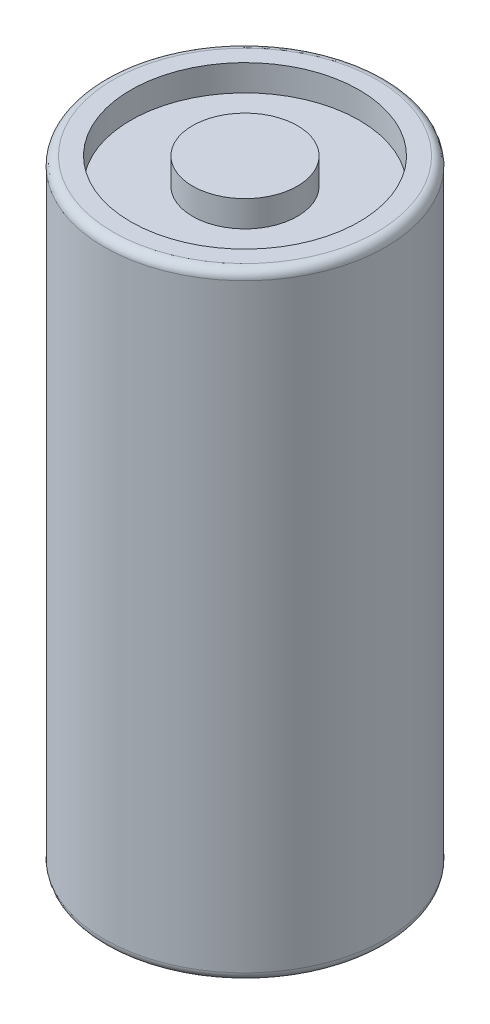
ISO-10303-21;
HEADER;
FILE_DESCRIPTION(('STEP AP214'),'2;1');
FILE_NAME('part.step','',(''),(''),'','','');
FILE_SCHEMA(('AUTOMOTIVE_DESIGN { 1 0 10303 214 1 1 1 1 }'));
ENDSEC;
DATA;
#1=APPLICATION_CONTEXT('core data for automotive mechanical design processes');
#2=APPLICATION_PROTOCOL_DEFINITION('international standard','automotive_design',2000,#1);
#3=PRODUCT_CONTEXT('',#1,'mechanical');
#4=PRODUCT('Part','Part','',(#3));
#5=PRODUCT_RELATED_PRODUCT_CATEGORY('part','',(#4));
#6=PRODUCT_DEFINITION_FORMATION('','',#4);
#7=PRODUCT_DEFINITION_CONTEXT('part definition',#1,'design');
#8=PRODUCT_DEFINITION('design','',#6,#7);
#9=PRODUCT_DEFINITION_SHAPE('','',#8);
#10=(LENGTH_UNIT() NAMED_UNIT(*) SI_UNIT(.MILLI.,.METRE.));
#11=(NAMED_UNIT(*) PLANE_ANGLE_UNIT() SI_UNIT($,.RADIAN.));
#12=(NAMED_UNIT(*) SI_UNIT($,.STERADIAN.) SOLID_ANGLE_UNIT());
#13=UNCERTAINTY_MEASURE_WITH_UNIT(LENGTH_MEASURE(1.E-05),#10,'distance_accuracy_value','');
#14=(GEOMETRIC_REPRESENTATION_CONTEXT(3) GLOBAL_UNCERTAINTY_ASSIGNED_CONTEXT((#13)) GLOBAL_UNIT_ASSIGNED_CONTEXT((#10,
#11,#12)) REPRESENTATION_CONTEXT('',''));
#15=CARTESIAN_POINT('',(0.,0.,0.));
#16=DIRECTION('',(0.,0.,1.));
#17=DIRECTION('',(1.,0.,0.));
#18=AXIS2_PLACEMENT_3D('',#15,#16,#17);
#19=CARTESIAN_POINT('',(0.,70.6,0.));
#20=DIRECTION('',(0.,-1.,0.));
#21=DIRECTION('',(0.,0.,-1.));
#22=AXIS2_PLACEMENT_3D('',#19,#20,#21);
#23=CYLINDRICAL_SURFACE('',#22,16.1);
#24=CARTESIAN_POINT('',(0.,69.6,0.));
#25=DIRECTION('',(0.,1.,0.));
#26=DIRECTION('',(0.,0.,1.));
#27=AXIS2_PLACEMENT_3D('',#24,#25,#26);
#28=CIRCLE('',#27,16.1);
#29=CARTESIAN_POINT('',(0.,69.6,16.1));
#30=VERTEX_POINT('',#29);
#31=EDGE_CURVE('E10',#30,#30,#28,.F.);
#32=ORIENTED_EDGE('',*,*,#31,.T.);
#33=EDGE_LOOP('',(#32));
#34=FACE_BOUND('',#33,.T.);
#35=CARTESIAN_POINT('',(0.,1.,0.));
#36=DIRECTION('',(0.,1.,0.));
#37=DIRECTION('',(0.,0.,1.));
#38=AXIS2_PLACEMENT_3D('',#35,#36,#37);
#39=CIRCLE('',#38,16.1);
#40=CARTESIAN_POINT('',(0.,1.,16.1));
#41=VERTEX_POINT('',#40);
#42=EDGE_CURVE('E51',#41,#41,#39,.T.);
#43=ORIENTED_EDGE('',*,*,#42,.T.);
#44=EDGE_LOOP('',(#43));
#45=FACE_BOUND('',#44,.T.);
#46=ADVANCED_FACE('F36',(#34,#45),#23,.T.);
#47=CARTESIAN_POINT('',(0.,70.6,0.));
#48=DIRECTION('',(0.,1.,0.));
#49=DIRECTION('',(0.,0.,1.));
#50=AXIS2_PLACEMENT_3D('',#47,#48,#49);
#51=PLANE('',#50);
#52=CARTESIAN_POINT('',(0.,70.6,0.));
#53=DIRECTION('',(0.,1.,0.));
#54=DIRECTION('',(0.,0.,1.));
#55=AXIS2_PLACEMENT_3D('',#52,#53,#54);
#56=CIRCLE('',#55,15.1);
#57=CARTESIAN_POINT('',(0.,70.6,15.1));
#58=VERTEX_POINT('',#57);
#59=EDGE_CURVE('E43',#58,#58,#56,.T.);
#60=ORIENTED_EDGE('',*,*,#59,.T.);
#61=EDGE_LOOP('',(#60));
#62=FACE_BOUND('',#61,.T.);
#63=CARTESIAN_POINT('',(0.,70.6,0.));
#64=DIRECTION('',(0.,1.,0.));
#65=DIRECTION('',(0.,0.,1.));
#66=AXIS2_PLACEMENT_3D('',#63,#64,#65);
#67=CIRCLE('',#66,13.0737764849024);
#68=CARTESIAN_POINT('',(0.,70.6,13.0737764849024));
#69=VERTEX_POINT('',#68);
#70=EDGE_CURVE('E57',#69,#69,#67,.T.);
#71=ORIENTED_EDGE('',*,*,#70,.F.);
#72=EDGE_LOOP('',(#71));
#73=FACE_BOUND('',#72,.T.);
#74=ADVANCED_FACE('F85',(#62,#73),#51,.T.);
#75=CARTESIAN_POINT('',(0.,0.,0.));
#76=DIRECTION('',(0.,1.,0.));
#77=DIRECTION('',(0.,0.,1.));
#78=AXIS2_PLACEMENT_3D('',#75,#76,#77);
#79=PLANE('',#78);
#80=CARTESIAN_POINT('',(0.,0.,0.));
#81=DIRECTION('',(0.,1.,0.));
#82=DIRECTION('',(0.,0.,1.));
#83=AXIS2_PLACEMENT_3D('',#80,#81,#82);
#84=CIRCLE('',#83,15.1);
#85=CARTESIAN_POINT('',(0.,0.,15.1));
#86=VERTEX_POINT('',#85);
#87=EDGE_CURVE('E47',#86,#86,#84,.F.);
#88=ORIENTED_EDGE('',*,*,#87,.T.);
#89=EDGE_LOOP('',(#88));
#90=FACE_BOUND('',#89,.T.);
#91=ADVANCED_FACE('F81',(#90),#79,.F.);
#92=CARTESIAN_POINT('',(0.,67.6,0.));
#93=DIRECTION('',(0.,1.,0.));
#94=DIRECTION('',(0.,0.,1.));
#95=AXIS2_PLACEMENT_3D('',#92,#93,#94);
#96=CYLINDRICAL_SURFACE('',#95,13.0737764849024);
#97=CARTESIAN_POINT('',(0.,67.6,0.));
#98=DIRECTION('',(0.,1.,0.));
#99=DIRECTION('',(0.,0.,1.));
#100=AXIS2_PLACEMENT_3D('',#97,#98,#99);
#101=CIRCLE('',#100,13.0737764849024);
#102=CARTESIAN_POINT('',(0.,67.6,13.0737764849024));
#103=VERTEX_POINT('',#102);
#104=EDGE_CURVE('E56',#103,#103,#101,.T.);
#105=ORIENTED_EDGE('',*,*,#104,.F.);
#106=EDGE_LOOP('',(#105));
#107=FACE_BOUND('',#106,.T.);
#108=ORIENTED_EDGE('',*,*,#70,.T.);
#109=EDGE_LOOP('',(#108));
#110=FACE_BOUND('',#109,.T.);
#111=ADVANCED_FACE('F75',(#107,#110),#96,.F.);
#112=CARTESIAN_POINT('',(0.,67.6,0.));
#113=DIRECTION('',(0.,1.,0.));
#114=DIRECTION('',(0.,0.,1.));
#115=AXIS2_PLACEMENT_3D('',#112,#113,#114);
#116=PLANE('',#115);
#117=CARTESIAN_POINT('',(0.,67.6,0.));
#118=DIRECTION('',(0.,1.,0.));
#119=DIRECTION('',(0.,0.,1.));
#120=AXIS2_PLACEMENT_3D('',#117,#118,#119);
#121=CIRCLE('',#120,6.);
#122=CARTESIAN_POINT('',(0.,67.6,6.));
#123=VERTEX_POINT('',#122);
#124=EDGE_CURVE('E60',#123,#123,#121,.T.);
#125=ORIENTED_EDGE('',*,*,#124,.F.);
#126=EDGE_LOOP('',(#125));
#127=FACE_BOUND('',#126,.T.);
#128=ORIENTED_EDGE('',*,*,#104,.T.);
#129=EDGE_LOOP('',(#128));
#130=FACE_BOUND('',#129,.T.);
#131=ADVANCED_FACE('F72',(#127,#130),#116,.T.);
#132=CARTESIAN_POINT('',(0.,67.6,0.));
#133=DIRECTION('',(0.,1.,0.));
#134=DIRECTION('',(0.,0.,1.));
#135=AXIS2_PLACEMENT_3D('',#132,#133,#134);
#136=CYLINDRICAL_SURFACE('',#135,6.);
#137=ORIENTED_EDGE('',*,*,#124,.T.);
#138=EDGE_LOOP('',(#137));
#139=FACE_BOUND('',#138,.T.);
#140=CARTESIAN_POINT('',(0.,70.6,0.));
#141=DIRECTION('',(0.,1.,0.));
#142=DIRECTION('',(0.,0.,1.));
#143=AXIS2_PLACEMENT_3D('',#140,#141,#142);
#144=CIRCLE('',#143,6.);
#145=CARTESIAN_POINT('',(0.,70.6,6.));
#146=VERTEX_POINT('',#145);
#147=EDGE_CURVE('E63',#146,#146,#144,.T.);
#148=ORIENTED_EDGE('',*,*,#147,.F.);
#149=EDGE_LOOP('',(#148));
#150=FACE_BOUND('',#149,.T.);
#151=ADVANCED_FACE('F69',(#139,#150),#136,.T.);
#152=ORIENTED_EDGE('',*,*,#147,.T.);
#153=EDGE_LOOP('',(#152));
#154=FACE_BOUND('',#153,.T.);
#155=ADVANCED_FACE('F88',(#154),#51,.T.);
#156=CARTESIAN_POINT('',(0.,1.,0.));
#157=DIRECTION('',(0.,1.,0.));
#158=DIRECTION('',(0.,0.,1.));
#159=AXIS2_PLACEMENT_3D('',#156,#157,#158);
#160=TOROIDAL_SURFACE('',#159,15.1,1.);
#161=ORIENTED_EDGE('',*,*,#87,.F.);
#162=EDGE_LOOP('',(#161));
#163=FACE_BOUND('',#162,.T.);
#164=ORIENTED_EDGE('',*,*,#42,.F.);
#165=EDGE_LOOP('',(#164));
#166=FACE_BOUND('',#165,.T.);
#167=ADVANCED_FACE('F97',(#163,#166),#160,.T.);
#168=CARTESIAN_POINT('',(0.,69.6,0.));
#169=DIRECTION('',(0.,1.,0.));
#170=DIRECTION('',(0.,0.,1.));
#171=AXIS2_PLACEMENT_3D('',#168,#169,#170);
#172=TOROIDAL_SURFACE('',#171,15.1,1.);
#173=ORIENTED_EDGE('',*,*,#31,.F.);
#174=EDGE_LOOP('',(#173));
#175=FACE_BOUND('',#174,.T.);
#176=ORIENTED_EDGE('',*,*,#59,.F.);
#177=EDGE_LOOP('',(#176));
#178=FACE_BOUND('',#177,.T.);
#179=ADVANCED_FACE('F38',(#175,#178),#172,.T.);
#180=CLOSED_SHELL('',(#46,#74,#91,#111,#131,#151,#155,#167,#179));
#181=MANIFOLD_SOLID_BREP('B2',#180);
#182=ADVANCED_BREP_SHAPE_REPRESENTATION('',(#18,#181),#14);
#183=SHAPE_DEFINITION_REPRESENTATION(#9,#182);
ENDSEC;
END-ISO-10303-21;
